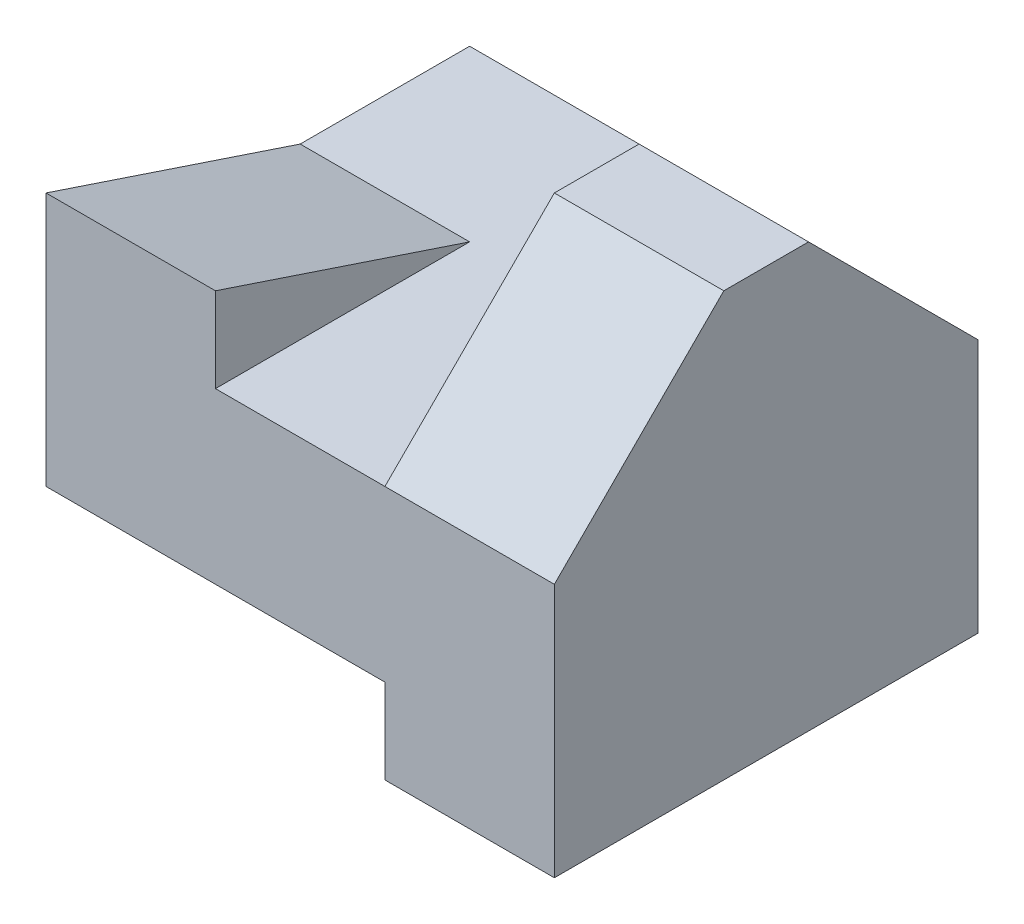
ISO-10303-21;
HEADER;
FILE_DESCRIPTION(('STEP AP214'),'2;1');
FILE_NAME('part.step','',(''),(''),'','','');
FILE_SCHEMA(('AUTOMOTIVE_DESIGN { 1 0 10303 214 1 1 1 1 }'));
ENDSEC;
DATA;
#1=APPLICATION_CONTEXT('core data for automotive mechanical design processes');
#2=APPLICATION_PROTOCOL_DEFINITION('international standard','automotive_design',2000,#1);
#3=PRODUCT_CONTEXT('',#1,'mechanical');
#4=PRODUCT('Part','Part','',(#3));
#5=PRODUCT_RELATED_PRODUCT_CATEGORY('part','',(#4));
#6=PRODUCT_DEFINITION_FORMATION('','',#4);
#7=PRODUCT_DEFINITION_CONTEXT('part definition',#1,'design');
#8=PRODUCT_DEFINITION('design','',#6,#7);
#9=PRODUCT_DEFINITION_SHAPE('','',#8);
#10=(LENGTH_UNIT() NAMED_UNIT(*) SI_UNIT(.MILLI.,.METRE.));
#11=(NAMED_UNIT(*) PLANE_ANGLE_UNIT() SI_UNIT($,.RADIAN.));
#12=(NAMED_UNIT(*) SI_UNIT($,.STERADIAN.) SOLID_ANGLE_UNIT());
#13=UNCERTAINTY_MEASURE_WITH_UNIT(LENGTH_MEASURE(1.E-05),#10,'distance_accuracy_value','');
#14=(GEOMETRIC_REPRESENTATION_CONTEXT(3) GLOBAL_UNCERTAINTY_ASSIGNED_CONTEXT((#13)) GLOBAL_UNIT_ASSIGNED_CONTEXT((#10,
#11,#12)) REPRESENTATION_CONTEXT('',''));
#15=CARTESIAN_POINT('',(0.,0.,0.));
#16=DIRECTION('',(0.,0.,1.));
#17=DIRECTION('',(1.,0.,0.));
#18=AXIS2_PLACEMENT_3D('',#15,#16,#17);
#19=CARTESIAN_POINT('',(10.,15.,-5.));
#20=DIRECTION('',(-1.,0.,0.));
#21=DIRECTION('',(0.,0.,1.));
#22=AXIS2_PLACEMENT_3D('',#19,#20,#21);
#23=PLANE('',#22);
#24=DIRECTION('',(0.,0.,1.));
#25=VECTOR('',#24,1.);
#26=CARTESIAN_POINT('',(10.,15.,-5.));
#27=LINE('',#26,#25);
#28=CARTESIAN_POINT('',(10.,15.,10.));
#29=VERTEX_POINT('',#28);
#30=CARTESIAN_POINT('',(10.,15.,25.));
#31=VERTEX_POINT('',#30);
#32=EDGE_CURVE('E133',#29,#31,#27,.T.);
#33=ORIENTED_EDGE('',*,*,#32,.F.);
#34=DIRECTION('',(0.,0.316227766016838,0.948683298050514));
#35=VECTOR('',#34,1.);
#36=CARTESIAN_POINT('',(10.,20.,25.));
#37=LINE('',#36,#35);
#38=CARTESIAN_POINT('',(10.,20.,25.));
#39=VERTEX_POINT('',#38);
#40=EDGE_CURVE('E140',#29,#39,#37,.T.);
#41=ORIENTED_EDGE('',*,*,#40,.T.);
#42=DIRECTION('',(0.,-1.,0.));
#43=VECTOR('',#42,1.);
#44=CARTESIAN_POINT('',(10.,15.,25.));
#45=LINE('',#44,#43);
#46=EDGE_CURVE('E149',#39,#31,#45,.T.);
#47=ORIENTED_EDGE('',*,*,#46,.T.);
#48=EDGE_LOOP('',(#33,#41,#47));
#49=FACE_BOUND('',#48,.T.);
#50=ADVANCED_FACE('F33',(#49),#23,.F.);
#51=CARTESIAN_POINT('',(0.,0.,25.));
#52=DIRECTION('',(0.,1.,0.));
#53=DIRECTION('',(0.,0.,1.));
#54=AXIS2_PLACEMENT_3D('',#51,#52,#53);
#55=PLANE('',#54);
#56=DIRECTION('',(0.,0.,1.));
#57=VECTOR('',#56,1.);
#58=CARTESIAN_POINT('',(10.,0.,-5.));
#59=LINE('',#58,#57);
#60=CARTESIAN_POINT('',(10.,0.,0.));
#61=VERTEX_POINT('',#60);
#62=CARTESIAN_POINT('',(10.,0.,10.));
#63=VERTEX_POINT('',#62);
#64=EDGE_CURVE('E167',#61,#63,#59,.T.);
#65=ORIENTED_EDGE('',*,*,#64,.T.);
#66=DIRECTION('',(-1.,0.,0.));
#67=VECTOR('',#66,1.);
#68=CARTESIAN_POINT('',(10.,0.,10.));
#69=LINE('',#68,#67);
#70=CARTESIAN_POINT('',(0.,0.,10.));
#71=VERTEX_POINT('',#70);
#72=EDGE_CURVE('E48',#63,#71,#69,.T.);
#73=ORIENTED_EDGE('',*,*,#72,.T.);
#74=DIRECTION('',(0.,0.,-1.));
#75=VECTOR('',#74,1.);
#76=CARTESIAN_POINT('',(0.,0.,25.));
#77=LINE('',#76,#75);
#78=CARTESIAN_POINT('',(0.,0.,0.));
#79=VERTEX_POINT('',#78);
#80=EDGE_CURVE('E217',#71,#79,#77,.T.);
#81=ORIENTED_EDGE('',*,*,#80,.T.);
#82=DIRECTION('',(1.,0.,0.));
#83=VECTOR('',#82,1.);
#84=CARTESIAN_POINT('',(0.,0.,0.));
#85=LINE('',#84,#83);
#86=EDGE_CURVE('E207',#79,#61,#85,.T.);
#87=ORIENTED_EDGE('',*,*,#86,.T.);
#88=EDGE_LOOP('',(#65,#73,#81,#87));
#89=FACE_BOUND('',#88,.T.);
#90=ADVANCED_FACE('F254',(#89),#55,.F.);
#91=CARTESIAN_POINT('',(0.,0.,25.));
#92=DIRECTION('',(1.,0.,0.));
#93=DIRECTION('',(0.,0.,-1.));
#94=AXIS2_PLACEMENT_3D('',#91,#92,#93);
#95=PLANE('',#94);
#96=DIRECTION('',(0.,0.316227766016838,0.948683298050514));
#97=VECTOR('',#96,1.);
#98=CARTESIAN_POINT('',(0.,20.,25.));
#99=LINE('',#98,#97);
#100=CARTESIAN_POINT('',(0.,15.,10.));
#101=VERTEX_POINT('',#100);
#102=CARTESIAN_POINT('',(0.,20.,25.));
#103=VERTEX_POINT('',#102);
#104=EDGE_CURVE('E147',#101,#103,#99,.T.);
#105=ORIENTED_EDGE('',*,*,#104,.F.);
#106=DIRECTION('',(0.,0.,1.));
#107=VECTOR('',#106,1.);
#108=CARTESIAN_POINT('',(0.,15.,10.));
#109=LINE('',#108,#107);
#110=CARTESIAN_POINT('',(0.,15.,0.));
#111=VERTEX_POINT('',#110);
#112=EDGE_CURVE('E136',#111,#101,#109,.T.);
#113=ORIENTED_EDGE('',*,*,#112,.F.);
#114=DIRECTION('',(0.,-1.,0.));
#115=VECTOR('',#114,1.);
#116=CARTESIAN_POINT('',(0.,0.,0.));
#117=LINE('',#116,#115);
#118=EDGE_CURVE('E186',#111,#79,#117,.T.);
#119=ORIENTED_EDGE('',*,*,#118,.T.);
#120=ORIENTED_EDGE('',*,*,#80,.F.);
#121=DIRECTION('',(0.,-0.316227766016838,-0.948683298050514));
#122=VECTOR('',#121,1.);
#123=CARTESIAN_POINT('',(0.,0.,10.));
#124=LINE('',#123,#122);
#125=CARTESIAN_POINT('',(0.,5.00000000000001,25.));
#126=VERTEX_POINT('',#125);
#127=EDGE_CURVE('E257',#126,#71,#124,.T.);
#128=ORIENTED_EDGE('',*,*,#127,.F.);
#129=DIRECTION('',(0.,-1.,0.));
#130=VECTOR('',#129,1.);
#131=CARTESIAN_POINT('',(0.,0.,25.));
#132=LINE('',#131,#130);
#133=EDGE_CURVE('E195',#103,#126,#132,.T.);
#134=ORIENTED_EDGE('',*,*,#133,.F.);
#135=EDGE_LOOP('',(#105,#113,#119,#120,#128,#134));
#136=FACE_BOUND('',#135,.T.);
#137=ADVANCED_FACE('F35',(#136),#95,.F.);
#138=DIRECTION('',(1.,0.,0.));
#139=VECTOR('',#138,1.);
#140=CARTESIAN_POINT('',(0.,0.,25.));
#141=LINE('',#140,#139);
#142=CARTESIAN_POINT('',(20.,0.,25.));
#143=VERTEX_POINT('',#142);
#144=CARTESIAN_POINT('',(30.,0.,25.));
#145=VERTEX_POINT('',#144);
#146=EDGE_CURVE('E198',#143,#145,#141,.T.);
#147=ORIENTED_EDGE('',*,*,#146,.F.);
#148=DIRECTION('',(0.,0.,1.));
#149=VECTOR('',#148,1.);
#150=CARTESIAN_POINT('',(20.,0.,-5.));
#151=LINE('',#150,#149);
#152=CARTESIAN_POINT('',(20.,0.,0.));
#153=VERTEX_POINT('',#152);
#154=EDGE_CURVE('E173',#153,#143,#151,.T.);
#155=ORIENTED_EDGE('',*,*,#154,.F.);
#156=CARTESIAN_POINT('',(30.,0.,0.));
#157=VERTEX_POINT('',#156);
#158=EDGE_CURVE('E206',#153,#157,#85,.T.);
#159=ORIENTED_EDGE('',*,*,#158,.T.);
#160=DIRECTION('',(0.,0.,-1.));
#161=VECTOR('',#160,1.);
#162=CARTESIAN_POINT('',(30.,0.,25.));
#163=LINE('',#162,#161);
#164=EDGE_CURVE('E214',#145,#157,#163,.T.);
#165=ORIENTED_EDGE('',*,*,#164,.F.);
#166=EDGE_LOOP('',(#147,#155,#159,#165));
#167=FACE_BOUND('',#166,.T.);
#168=ADVANCED_FACE('F237',(#167),#55,.F.);
#169=CARTESIAN_POINT('',(30.,0.,25.));
#170=DIRECTION('',(-1.,0.,0.));
#171=DIRECTION('',(0.,0.,1.));
#172=AXIS2_PLACEMENT_3D('',#169,#170,#171);
#173=PLANE('',#172);
#174=DIRECTION('',(0.,0.,-1.));
#175=VECTOR('',#174,1.);
#176=CARTESIAN_POINT('',(30.,25.,25.));
#177=LINE('',#176,#175);
#178=CARTESIAN_POINT('',(30.,25.,15.));
#179=VERTEX_POINT('',#178);
#180=CARTESIAN_POINT('',(30.,25.,10.));
#181=VERTEX_POINT('',#180);
#182=EDGE_CURVE('E204',#179,#181,#177,.T.);
#183=ORIENTED_EDGE('',*,*,#182,.F.);
#184=DIRECTION('',(0.,0.707106781186548,-0.707106781186548));
#185=VECTOR('',#184,1.);
#186=CARTESIAN_POINT('',(30.,15.,25.));
#187=LINE('',#186,#185);
#188=CARTESIAN_POINT('',(30.,15.,25.));
#189=VERTEX_POINT('',#188);
#190=EDGE_CURVE('E180',#189,#179,#187,.T.);
#191=ORIENTED_EDGE('',*,*,#190,.F.);
#192=DIRECTION('',(0.,1.,0.));
#193=VECTOR('',#192,1.);
#194=CARTESIAN_POINT('',(30.,0.,25.));
#195=LINE('',#194,#193);
#196=EDGE_CURVE('E201',#145,#189,#195,.T.);
#197=ORIENTED_EDGE('',*,*,#196,.F.);
#198=ORIENTED_EDGE('',*,*,#164,.T.);
#199=DIRECTION('',(0.,1.,0.));
#200=VECTOR('',#199,1.);
#201=CARTESIAN_POINT('',(30.,0.,0.));
#202=LINE('',#201,#200);
#203=CARTESIAN_POINT('',(30.,15.,0.));
#204=VERTEX_POINT('',#203);
#205=EDGE_CURVE('E199',#157,#204,#202,.T.);
#206=ORIENTED_EDGE('',*,*,#205,.T.);
#207=DIRECTION('',(0.,-0.707106781186547,-0.707106781186548));
#208=VECTOR('',#207,1.);
#209=CARTESIAN_POINT('',(30.,15.,0.));
#210=LINE('',#209,#208);
#211=EDGE_CURVE('E171',#181,#204,#210,.T.);
#212=ORIENTED_EDGE('',*,*,#211,.F.);
#213=EDGE_LOOP('',(#183,#191,#197,#198,#206,#212));
#214=FACE_BOUND('',#213,.T.);
#215=ADVANCED_FACE('F268',(#214),#173,.F.);
#216=CARTESIAN_POINT('',(0.,25.,25.));
#217=DIRECTION('',(0.,-1.,0.));
#218=DIRECTION('',(0.,0.,-1.));
#219=AXIS2_PLACEMENT_3D('',#216,#217,#218);
#220=PLANE('',#219);
#221=DIRECTION('',(1.,0.,0.));
#222=VECTOR('',#221,1.);
#223=CARTESIAN_POINT('',(20.,25.,10.));
#224=LINE('',#223,#222);
#225=CARTESIAN_POINT('',(20.,25.,10.));
#226=VERTEX_POINT('',#225);
#227=EDGE_CURVE('E182',#226,#181,#224,.T.);
#228=ORIENTED_EDGE('',*,*,#227,.F.);
#229=DIRECTION('',(0.,0.,1.));
#230=VECTOR('',#229,1.);
#231=CARTESIAN_POINT('',(20.,25.,-5.));
#232=LINE('',#231,#230);
#233=CARTESIAN_POINT('',(20.,25.,15.));
#234=VERTEX_POINT('',#233);
#235=EDGE_CURVE('E155',#226,#234,#232,.T.);
#236=ORIENTED_EDGE('',*,*,#235,.T.);
#237=DIRECTION('',(1.,0.,0.));
#238=VECTOR('',#237,1.);
#239=CARTESIAN_POINT('',(20.,25.,15.));
#240=LINE('',#239,#238);
#241=EDGE_CURVE('E183',#234,#179,#240,.T.);
#242=ORIENTED_EDGE('',*,*,#241,.T.);
#243=ORIENTED_EDGE('',*,*,#182,.T.);
#244=EDGE_LOOP('',(#228,#236,#242,#243));
#245=FACE_BOUND('',#244,.T.);
#246=ADVANCED_FACE('F271',(#245),#220,.F.);
#247=CARTESIAN_POINT('',(0.,0.,25.));
#248=DIRECTION('',(0.,0.,-1.));
#249=DIRECTION('',(-1.,0.,0.));
#250=AXIS2_PLACEMENT_3D('',#247,#248,#249);
#251=PLANE('',#250);
#252=ORIENTED_EDGE('',*,*,#133,.T.);
#253=DIRECTION('',(-1.,0.,0.));
#254=VECTOR('',#253,1.);
#255=CARTESIAN_POINT('',(10.,5.00000000000001,25.));
#256=LINE('',#255,#254);
#257=CARTESIAN_POINT('',(10.,5.00000000000001,25.));
#258=VERTEX_POINT('',#257);
#259=EDGE_CURVE('E245',#258,#126,#256,.T.);
#260=ORIENTED_EDGE('',*,*,#259,.F.);
#261=DIRECTION('',(-1.,0.,0.));
#262=VECTOR('',#261,1.);
#263=CARTESIAN_POINT('',(10.,5.,25.));
#264=LINE('',#263,#262);
#265=CARTESIAN_POINT('',(20.,5.,25.));
#266=VERTEX_POINT('',#265);
#267=EDGE_CURVE('E164',#266,#258,#264,.T.);
#268=ORIENTED_EDGE('',*,*,#267,.F.);
#269=DIRECTION('',(0.,1.,0.));
#270=VECTOR('',#269,1.);
#271=CARTESIAN_POINT('',(20.,0.,25.));
#272=LINE('',#271,#270);
#273=EDGE_CURVE('E162',#143,#266,#272,.T.);
#274=ORIENTED_EDGE('',*,*,#273,.F.);
#275=ORIENTED_EDGE('',*,*,#146,.T.);
#276=ORIENTED_EDGE('',*,*,#196,.T.);
#277=DIRECTION('',(1.,0.,0.));
#278=VECTOR('',#277,1.);
#279=CARTESIAN_POINT('',(20.,15.,25.));
#280=LINE('',#279,#278);
#281=CARTESIAN_POINT('',(20.,15.,25.));
#282=VERTEX_POINT('',#281);
#283=EDGE_CURVE('E179',#282,#189,#280,.T.);
#284=ORIENTED_EDGE('',*,*,#283,.F.);
#285=DIRECTION('',(1.,0.,0.));
#286=VECTOR('',#285,1.);
#287=CARTESIAN_POINT('',(20.,15.,25.));
#288=LINE('',#287,#286);
#289=EDGE_CURVE('E152',#31,#282,#288,.T.);
#290=ORIENTED_EDGE('',*,*,#289,.F.);
#291=ORIENTED_EDGE('',*,*,#46,.F.);
#292=DIRECTION('',(1.,0.,0.));
#293=VECTOR('',#292,1.);
#294=CARTESIAN_POINT('',(10.,20.,25.));
#295=LINE('',#294,#293);
#296=EDGE_CURVE('E139',#103,#39,#295,.T.);
#297=ORIENTED_EDGE('',*,*,#296,.F.);
#298=EDGE_LOOP('',(#252,#260,#268,#274,#275,#276,#284,#290,#291,#297));
#299=FACE_BOUND('',#298,.T.);
#300=ADVANCED_FACE('F241',(#299),#251,.F.);
#301=CARTESIAN_POINT('',(0.,0.,0.));
#302=DIRECTION('',(0.,0.,-1.));
#303=DIRECTION('',(-1.,0.,0.));
#304=AXIS2_PLACEMENT_3D('',#301,#302,#303);
#305=PLANE('',#304);
#306=ORIENTED_EDGE('',*,*,#118,.F.);
#307=DIRECTION('',(-1.,0.,0.));
#308=VECTOR('',#307,1.);
#309=CARTESIAN_POINT('',(0.,15.,0.));
#310=LINE('',#309,#308);
#311=CARTESIAN_POINT('',(20.,15.,0.));
#312=VERTEX_POINT('',#311);
#313=EDGE_CURVE('E160',#312,#111,#310,.T.);
#314=ORIENTED_EDGE('',*,*,#313,.F.);
#315=DIRECTION('',(1.,0.,0.));
#316=VECTOR('',#315,1.);
#317=CARTESIAN_POINT('',(20.,15.,0.));
#318=LINE('',#317,#316);
#319=EDGE_CURVE('E190',#312,#204,#318,.T.);
#320=ORIENTED_EDGE('',*,*,#319,.T.);
#321=ORIENTED_EDGE('',*,*,#205,.F.);
#322=ORIENTED_EDGE('',*,*,#158,.F.);
#323=DIRECTION('',(0.,-1.,0.));
#324=VECTOR('',#323,1.);
#325=CARTESIAN_POINT('',(20.,0.,0.));
#326=LINE('',#325,#324);
#327=CARTESIAN_POINT('',(20.,5.,0.));
#328=VERTEX_POINT('',#327);
#329=EDGE_CURVE('E220',#328,#153,#326,.T.);
#330=ORIENTED_EDGE('',*,*,#329,.F.);
#331=DIRECTION('',(1.,0.,0.));
#332=VECTOR('',#331,1.);
#333=CARTESIAN_POINT('',(0.,5.,0.));
#334=LINE('',#333,#332);
#335=CARTESIAN_POINT('',(10.,5.,0.));
#336=VERTEX_POINT('',#335);
#337=EDGE_CURVE('E41',#336,#328,#334,.T.);
#338=ORIENTED_EDGE('',*,*,#337,.F.);
#339=DIRECTION('',(0.,1.,0.));
#340=VECTOR('',#339,1.);
#341=CARTESIAN_POINT('',(10.,0.,0.));
#342=LINE('',#341,#340);
#343=EDGE_CURVE('E11',#61,#336,#342,.T.);
#344=ORIENTED_EDGE('',*,*,#343,.F.);
#345=ORIENTED_EDGE('',*,*,#86,.F.);
#346=EDGE_LOOP('',(#306,#314,#320,#321,#322,#330,#338,#344,#345));
#347=FACE_BOUND('',#346,.T.);
#348=ADVANCED_FACE('F230',(#347),#305,.T.);
#349=CARTESIAN_POINT('',(20.,15.,0.));
#350=DIRECTION('',(0.,-0.707106781186548,0.707106781186547));
#351=DIRECTION('',(0.,-0.707106781186547,-0.707106781186548));
#352=AXIS2_PLACEMENT_3D('',#349,#350,#351);
#353=PLANE('',#352);
#354=ORIENTED_EDGE('',*,*,#211,.T.);
#355=ORIENTED_EDGE('',*,*,#319,.F.);
#356=DIRECTION('',(0.,-0.707106781186547,-0.707106781186548));
#357=VECTOR('',#356,1.);
#358=CARTESIAN_POINT('',(20.,15.,0.));
#359=LINE('',#358,#357);
#360=EDGE_CURVE('E188',#226,#312,#359,.T.);
#361=ORIENTED_EDGE('',*,*,#360,.F.);
#362=ORIENTED_EDGE('',*,*,#227,.T.);
#363=EDGE_LOOP('',(#354,#355,#361,#362));
#364=FACE_BOUND('',#363,.T.);
#365=ADVANCED_FACE('F263',(#364),#353,.F.);
#366=CARTESIAN_POINT('',(20.,15.,25.));
#367=DIRECTION('',(0.,-0.707106781186548,-0.707106781186548));
#368=DIRECTION('',(0.,0.707106781186548,-0.707106781186548));
#369=AXIS2_PLACEMENT_3D('',#366,#367,#368);
#370=PLANE('',#369);
#371=ORIENTED_EDGE('',*,*,#190,.T.);
#372=ORIENTED_EDGE('',*,*,#241,.F.);
#373=DIRECTION('',(0.,0.707106781186548,-0.707106781186548));
#374=VECTOR('',#373,1.);
#375=CARTESIAN_POINT('',(20.,15.,25.));
#376=LINE('',#375,#374);
#377=EDGE_CURVE('E177',#282,#234,#376,.T.);
#378=ORIENTED_EDGE('',*,*,#377,.F.);
#379=ORIENTED_EDGE('',*,*,#283,.T.);
#380=EDGE_LOOP('',(#371,#372,#378,#379));
#381=FACE_BOUND('',#380,.T.);
#382=ADVANCED_FACE('F276',(#381),#370,.F.);
#383=CARTESIAN_POINT('',(10.,0.,-5.));
#384=DIRECTION('',(-1.,0.,0.));
#385=DIRECTION('',(0.,0.,1.));
#386=AXIS2_PLACEMENT_3D('',#383,#384,#385);
#387=PLANE('',#386);
#388=DIRECTION('',(0.,0.,1.));
#389=VECTOR('',#388,1.);
#390=CARTESIAN_POINT('',(10.,5.,-5.));
#391=LINE('',#390,#389);
#392=EDGE_CURVE('E168',#336,#258,#391,.T.);
#393=ORIENTED_EDGE('',*,*,#392,.T.);
#394=DIRECTION('',(0.,-0.316227766016838,-0.948683298050514));
#395=VECTOR('',#394,1.);
#396=CARTESIAN_POINT('',(10.,0.,10.));
#397=LINE('',#396,#395);
#398=EDGE_CURVE('E248',#258,#63,#397,.T.);
#399=ORIENTED_EDGE('',*,*,#398,.T.);
#400=ORIENTED_EDGE('',*,*,#64,.F.);
#401=ORIENTED_EDGE('',*,*,#343,.T.);
#402=EDGE_LOOP('',(#393,#399,#400,#401));
#403=FACE_BOUND('',#402,.T.);
#404=ADVANCED_FACE('F251',(#403),#387,.F.);
#405=CARTESIAN_POINT('',(10.,5.,-5.));
#406=DIRECTION('',(0.,1.,0.));
#407=DIRECTION('',(0.,0.,1.));
#408=AXIS2_PLACEMENT_3D('',#405,#406,#407);
#409=PLANE('',#408);
#410=ORIENTED_EDGE('',*,*,#337,.T.);
#411=DIRECTION('',(0.,0.,1.));
#412=VECTOR('',#411,1.);
#413=CARTESIAN_POINT('',(20.,5.,-5.));
#414=LINE('',#413,#412);
#415=EDGE_CURVE('E56',#328,#266,#414,.T.);
#416=ORIENTED_EDGE('',*,*,#415,.T.);
#417=ORIENTED_EDGE('',*,*,#267,.T.);
#418=ORIENTED_EDGE('',*,*,#392,.F.);
#419=EDGE_LOOP('',(#410,#416,#417,#418));
#420=FACE_BOUND('',#419,.T.);
#421=ADVANCED_FACE('F225',(#420),#409,.F.);
#422=CARTESIAN_POINT('',(20.,0.,-5.));
#423=DIRECTION('',(1.,0.,0.));
#424=DIRECTION('',(0.,0.,-1.));
#425=AXIS2_PLACEMENT_3D('',#422,#423,#424);
#426=PLANE('',#425);
#427=ORIENTED_EDGE('',*,*,#329,.T.);
#428=ORIENTED_EDGE('',*,*,#154,.T.);
#429=ORIENTED_EDGE('',*,*,#273,.T.);
#430=ORIENTED_EDGE('',*,*,#415,.F.);
#431=EDGE_LOOP('',(#427,#428,#429,#430));
#432=FACE_BOUND('',#431,.T.);
#433=ADVANCED_FACE('F233',(#432),#426,.F.);
#434=CARTESIAN_POINT('',(20.,25.,-5.));
#435=DIRECTION('',(1.,0.,0.));
#436=DIRECTION('',(0.,0.,-1.));
#437=AXIS2_PLACEMENT_3D('',#434,#435,#436);
#438=PLANE('',#437);
#439=DIRECTION('',(0.,0.,1.));
#440=VECTOR('',#439,1.);
#441=CARTESIAN_POINT('',(20.,15.,-5.));
#442=LINE('',#441,#440);
#443=EDGE_CURVE('E151',#312,#282,#442,.T.);
#444=ORIENTED_EDGE('',*,*,#443,.T.);
#445=ORIENTED_EDGE('',*,*,#377,.T.);
#446=ORIENTED_EDGE('',*,*,#235,.F.);
#447=ORIENTED_EDGE('',*,*,#360,.T.);
#448=EDGE_LOOP('',(#444,#445,#446,#447));
#449=FACE_BOUND('',#448,.T.);
#450=ADVANCED_FACE('F278',(#449),#438,.F.);
#451=CARTESIAN_POINT('',(20.,15.,-5.));
#452=DIRECTION('',(0.,-1.,0.));
#453=DIRECTION('',(0.,0.,-1.));
#454=AXIS2_PLACEMENT_3D('',#451,#452,#453);
#455=PLANE('',#454);
#456=ORIENTED_EDGE('',*,*,#313,.T.);
#457=ORIENTED_EDGE('',*,*,#112,.T.);
#458=DIRECTION('',(-1.,0.,0.));
#459=VECTOR('',#458,1.);
#460=CARTESIAN_POINT('',(10.,15.,10.));
#461=LINE('',#460,#459);
#462=EDGE_CURVE('E129',#29,#101,#461,.T.);
#463=ORIENTED_EDGE('',*,*,#462,.F.);
#464=ORIENTED_EDGE('',*,*,#32,.T.);
#465=ORIENTED_EDGE('',*,*,#289,.T.);
#466=ORIENTED_EDGE('',*,*,#443,.F.);
#467=EDGE_LOOP('',(#456,#457,#463,#464,#465,#466));
#468=FACE_BOUND('',#467,.T.);
#469=ADVANCED_FACE('F131',(#468),#455,.F.);
#470=CARTESIAN_POINT('',(10.,20.,25.));
#471=DIRECTION('',(0.,-0.948683298050514,0.316227766016838));
#472=DIRECTION('',(0.,-0.316227766016838,-0.948683298050514));
#473=AXIS2_PLACEMENT_3D('',#470,#471,#472);
#474=PLANE('',#473);
#475=ORIENTED_EDGE('',*,*,#104,.T.);
#476=ORIENTED_EDGE('',*,*,#296,.T.);
#477=ORIENTED_EDGE('',*,*,#40,.F.);
#478=ORIENTED_EDGE('',*,*,#462,.T.);
#479=EDGE_LOOP('',(#475,#476,#477,#478));
#480=FACE_BOUND('',#479,.T.);
#481=ADVANCED_FACE('F143',(#480),#474,.F.);
#482=CARTESIAN_POINT('',(10.,0.,10.));
#483=DIRECTION('',(0.,0.948683298050514,-0.316227766016838));
#484=DIRECTION('',(0.,0.316227766016838,0.948683298050514));
#485=AXIS2_PLACEMENT_3D('',#482,#483,#484);
#486=PLANE('',#485);
#487=ORIENTED_EDGE('',*,*,#127,.T.);
#488=ORIENTED_EDGE('',*,*,#72,.F.);
#489=ORIENTED_EDGE('',*,*,#398,.F.);
#490=ORIENTED_EDGE('',*,*,#259,.T.);
#491=EDGE_LOOP('',(#487,#488,#489,#490));
#492=FACE_BOUND('',#491,.T.);
#493=ADVANCED_FACE('F286',(#492),#486,.F.);
#494=CLOSED_SHELL('',(#50,#90,#137,#168,#215,#246,#300,#348,#365,#382,#404,#421,#433,#450,#469,
#481,#493));
#495=MANIFOLD_SOLID_BREP('B2',#494);
#496=ADVANCED_BREP_SHAPE_REPRESENTATION('',(#18,#495),#14);
#497=SHAPE_DEFINITION_REPRESENTATION(#9,#496);
ENDSEC;
END-ISO-10303-21;
